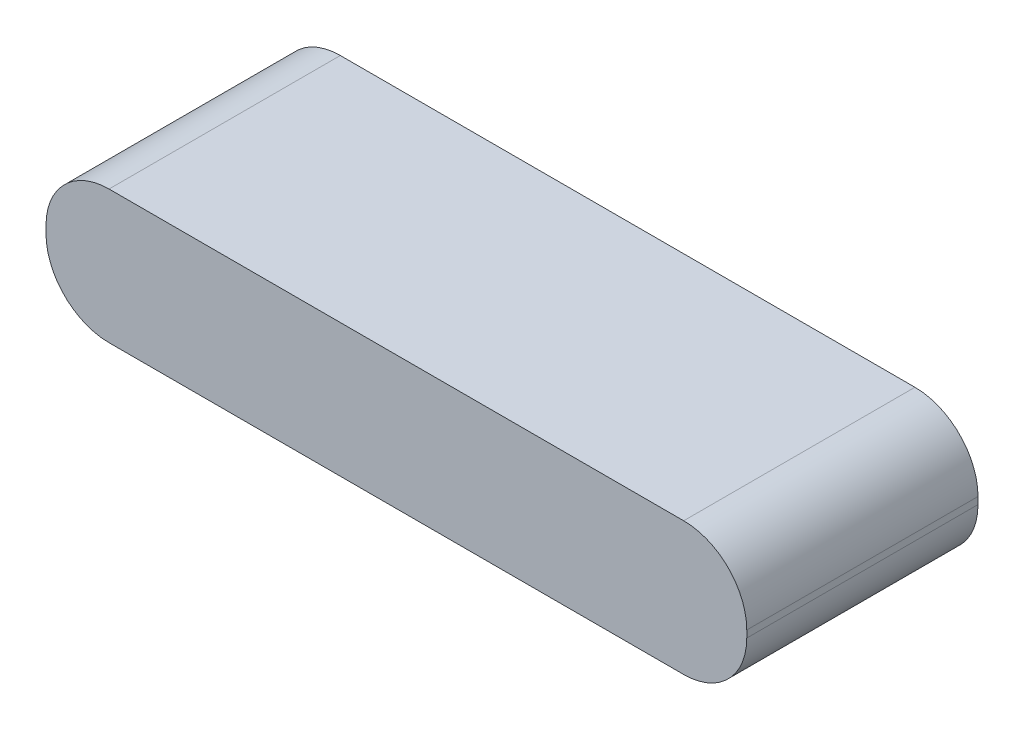
ISO-10303-21;
HEADER;
FILE_DESCRIPTION(('STEP AP214'),'2;1');
FILE_NAME('part.step','',(''),(''),'','','');
FILE_SCHEMA(('AUTOMOTIVE_DESIGN { 1 0 10303 214 1 1 1 1 }'));
ENDSEC;
DATA;
#1=APPLICATION_CONTEXT('core data for automotive mechanical design processes');
#2=APPLICATION_PROTOCOL_DEFINITION('international standard','automotive_design',2000,#1);
#3=PRODUCT_CONTEXT('',#1,'mechanical');
#4=PRODUCT('Part','Part','',(#3));
#5=PRODUCT_RELATED_PRODUCT_CATEGORY('part','',(#4));
#6=PRODUCT_DEFINITION_FORMATION('','',#4);
#7=PRODUCT_DEFINITION_CONTEXT('part definition',#1,'design');
#8=PRODUCT_DEFINITION('design','',#6,#7);
#9=PRODUCT_DEFINITION_SHAPE('','',#8);
#10=(LENGTH_UNIT() NAMED_UNIT(*) SI_UNIT(.MILLI.,.METRE.));
#11=(NAMED_UNIT(*) PLANE_ANGLE_UNIT() SI_UNIT($,.RADIAN.));
#12=(NAMED_UNIT(*) SI_UNIT($,.STERADIAN.) SOLID_ANGLE_UNIT());
#13=UNCERTAINTY_MEASURE_WITH_UNIT(LENGTH_MEASURE(1.E-05),#10,'distance_accuracy_value','');
#14=(GEOMETRIC_REPRESENTATION_CONTEXT(3) GLOBAL_UNCERTAINTY_ASSIGNED_CONTEXT((#13)) GLOBAL_UNIT_ASSIGNED_CONTEXT((#10,
#11,#12)) REPRESENTATION_CONTEXT('',''));
#15=CARTESIAN_POINT('',(0.,0.,0.));
#16=DIRECTION('',(0.,0.,1.));
#17=DIRECTION('',(1.,0.,0.));
#18=AXIS2_PLACEMENT_3D('',#15,#16,#17);
#19=CARTESIAN_POINT('',(50.,19.,-16.5));
#20=DIRECTION('',(-1.,0.,0.));
#21=DIRECTION('',(0.,0.,1.));
#22=AXIS2_PLACEMENT_3D('',#19,#20,#21);
#23=PLANE('',#22);
#24=DIRECTION('',(0.,-1.,0.));
#25=VECTOR('',#24,1.);
#26=CARTESIAN_POINT('',(50.,19.,16.5));
#27=LINE('',#26,#25);
#28=CARTESIAN_POINT('',(50.,10.,16.5));
#29=VERTEX_POINT('',#28);
#30=CARTESIAN_POINT('',(50.,9.,16.5));
#31=VERTEX_POINT('',#30);
#32=EDGE_CURVE('E122',#29,#31,#27,.T.);
#33=ORIENTED_EDGE('',*,*,#32,.T.);
#34=DIRECTION('',(0.,0.,-1.));
#35=VECTOR('',#34,1.);
#36=CARTESIAN_POINT('',(50.,9.,-16.5));
#37=LINE('',#36,#35);
#38=CARTESIAN_POINT('',(50.,9.,-16.5));
#39=VERTEX_POINT('',#38);
#40=EDGE_CURVE('E11',#31,#39,#37,.T.);
#41=ORIENTED_EDGE('',*,*,#40,.T.);
#42=DIRECTION('',(0.,-1.,0.));
#43=VECTOR('',#42,1.);
#44=CARTESIAN_POINT('',(50.,19.,-16.5));
#45=LINE('',#44,#43);
#46=CARTESIAN_POINT('',(50.,10.,-16.5));
#47=VERTEX_POINT('',#46);
#48=EDGE_CURVE('E127',#47,#39,#45,.T.);
#49=ORIENTED_EDGE('',*,*,#48,.F.);
#50=DIRECTION('',(0.,0.,-1.));
#51=VECTOR('',#50,1.);
#52=CARTESIAN_POINT('',(50.,10.,16.5));
#53=LINE('',#52,#51);
#54=EDGE_CURVE('E42',#47,#29,#53,.F.);
#55=ORIENTED_EDGE('',*,*,#54,.T.);
#56=EDGE_LOOP('',(#33,#41,#49,#55));
#57=FACE_BOUND('',#56,.T.);
#58=ADVANCED_FACE('F34',(#57),#23,.F.);
#59=CARTESIAN_POINT('',(-50.,19.,-16.5));
#60=DIRECTION('',(0.,0.,1.));
#61=DIRECTION('',(1.,0.,0.));
#62=AXIS2_PLACEMENT_3D('',#59,#60,#61);
#63=PLANE('',#62);
#64=DIRECTION('',(-1.,0.,0.));
#65=VECTOR('',#64,1.);
#66=CARTESIAN_POINT('',(-50.,0.,-16.5));
#67=LINE('',#66,#65);
#68=CARTESIAN_POINT('',(41.,0.,-16.5));
#69=VERTEX_POINT('',#68);
#70=CARTESIAN_POINT('',(-41.,0.,-16.5));
#71=VERTEX_POINT('',#70);
#72=EDGE_CURVE('E169',#69,#71,#67,.T.);
#73=ORIENTED_EDGE('',*,*,#72,.T.);
#74=CARTESIAN_POINT('',(-41.,9.,-16.5));
#75=DIRECTION('',(0.,0.,1.));
#76=DIRECTION('',(1.,0.,0.));
#77=AXIS2_PLACEMENT_3D('',#74,#75,#76);
#78=CIRCLE('',#77,9.);
#79=CARTESIAN_POINT('',(-50.,9.,-16.5));
#80=VERTEX_POINT('',#79);
#81=EDGE_CURVE('E144',#71,#80,#78,.F.);
#82=ORIENTED_EDGE('',*,*,#81,.T.);
#83=DIRECTION('',(0.,-1.,0.));
#84=VECTOR('',#83,1.);
#85=CARTESIAN_POINT('',(-50.,19.,-16.5));
#86=LINE('',#85,#84);
#87=CARTESIAN_POINT('',(-50.,10.,-16.5));
#88=VERTEX_POINT('',#87);
#89=EDGE_CURVE('E121',#88,#80,#86,.T.);
#90=ORIENTED_EDGE('',*,*,#89,.F.);
#91=CARTESIAN_POINT('',(-41.,10.,-16.5));
#92=DIRECTION('',(0.,0.,1.));
#93=DIRECTION('',(1.,0.,0.));
#94=AXIS2_PLACEMENT_3D('',#91,#92,#93);
#95=CIRCLE('',#94,9.);
#96=CARTESIAN_POINT('',(-41.,19.,-16.5));
#97=VERTEX_POINT('',#96);
#98=EDGE_CURVE('E126',#88,#97,#95,.F.);
#99=ORIENTED_EDGE('',*,*,#98,.T.);
#100=DIRECTION('',(-1.,0.,0.));
#101=VECTOR('',#100,1.);
#102=CARTESIAN_POINT('',(-50.,19.,-16.5));
#103=LINE('',#102,#101);
#104=CARTESIAN_POINT('',(41.,19.,-16.5));
#105=VERTEX_POINT('',#104);
#106=EDGE_CURVE('E163',#105,#97,#103,.T.);
#107=ORIENTED_EDGE('',*,*,#106,.F.);
#108=CARTESIAN_POINT('',(41.,10.,-16.5));
#109=DIRECTION('',(0.,0.,1.));
#110=DIRECTION('',(1.,0.,0.));
#111=AXIS2_PLACEMENT_3D('',#108,#109,#110);
#112=CIRCLE('',#111,9.);
#113=EDGE_CURVE('E56',#105,#47,#112,.F.);
#114=ORIENTED_EDGE('',*,*,#113,.T.);
#115=ORIENTED_EDGE('',*,*,#48,.T.);
#116=CARTESIAN_POINT('',(41.,9.,-16.5));
#117=DIRECTION('',(0.,0.,1.));
#118=DIRECTION('',(1.,0.,0.));
#119=AXIS2_PLACEMENT_3D('',#116,#117,#118);
#120=CIRCLE('',#119,9.);
#121=EDGE_CURVE('E49',#39,#69,#120,.F.);
#122=ORIENTED_EDGE('',*,*,#121,.T.);
#123=EDGE_LOOP('',(#73,#82,#90,#99,#107,#114,#115,#122));
#124=FACE_BOUND('',#123,.T.);
#125=ADVANCED_FACE('F165',(#124),#63,.F.);
#126=CARTESIAN_POINT('',(-50.,19.,-16.5));
#127=DIRECTION('',(1.,0.,0.));
#128=DIRECTION('',(0.,0.,-1.));
#129=AXIS2_PLACEMENT_3D('',#126,#127,#128);
#130=PLANE('',#129);
#131=ORIENTED_EDGE('',*,*,#89,.T.);
#132=DIRECTION('',(0.,0.,1.));
#133=VECTOR('',#132,1.);
#134=CARTESIAN_POINT('',(-50.,9.,-16.5));
#135=LINE('',#134,#133);
#136=CARTESIAN_POINT('',(-50.,9.,16.5));
#137=VERTEX_POINT('',#136);
#138=EDGE_CURVE('E120',#80,#137,#135,.T.);
#139=ORIENTED_EDGE('',*,*,#138,.T.);
#140=DIRECTION('',(0.,-1.,0.));
#141=VECTOR('',#140,1.);
#142=CARTESIAN_POINT('',(-50.,19.,16.5));
#143=LINE('',#142,#141);
#144=CARTESIAN_POINT('',(-50.,10.,16.5));
#145=VERTEX_POINT('',#144);
#146=EDGE_CURVE('E103',#145,#137,#143,.T.);
#147=ORIENTED_EDGE('',*,*,#146,.F.);
#148=DIRECTION('',(0.,0.,1.));
#149=VECTOR('',#148,1.);
#150=CARTESIAN_POINT('',(-50.,10.,-16.5));
#151=LINE('',#150,#149);
#152=EDGE_CURVE('E117',#145,#88,#151,.F.);
#153=ORIENTED_EDGE('',*,*,#152,.T.);
#154=EDGE_LOOP('',(#131,#139,#147,#153));
#155=FACE_BOUND('',#154,.T.);
#156=ADVANCED_FACE('F116',(#155),#130,.F.);
#157=CARTESIAN_POINT('',(-50.,19.,16.5));
#158=DIRECTION('',(0.,0.,-1.));
#159=DIRECTION('',(-1.,0.,0.));
#160=AXIS2_PLACEMENT_3D('',#157,#158,#159);
#161=PLANE('',#160);
#162=ORIENTED_EDGE('',*,*,#146,.T.);
#163=CARTESIAN_POINT('',(-41.,9.,16.5));
#164=DIRECTION('',(0.,0.,-1.));
#165=DIRECTION('',(-1.,0.,0.));
#166=AXIS2_PLACEMENT_3D('',#163,#164,#165);
#167=CIRCLE('',#166,9.);
#168=CARTESIAN_POINT('',(-41.,0.,16.5));
#169=VERTEX_POINT('',#168);
#170=EDGE_CURVE('E110',#137,#169,#167,.F.);
#171=ORIENTED_EDGE('',*,*,#170,.T.);
#172=DIRECTION('',(1.,0.,0.));
#173=VECTOR('',#172,1.);
#174=CARTESIAN_POINT('',(-50.,0.,16.5));
#175=LINE('',#174,#173);
#176=CARTESIAN_POINT('',(41.,0.,16.5));
#177=VERTEX_POINT('',#176);
#178=EDGE_CURVE('E166',#169,#177,#175,.T.);
#179=ORIENTED_EDGE('',*,*,#178,.T.);
#180=CARTESIAN_POINT('',(41.,9.,16.5));
#181=DIRECTION('',(0.,0.,-1.));
#182=DIRECTION('',(-1.,0.,0.));
#183=AXIS2_PLACEMENT_3D('',#180,#181,#182);
#184=CIRCLE('',#183,9.);
#185=EDGE_CURVE('E111',#177,#31,#184,.F.);
#186=ORIENTED_EDGE('',*,*,#185,.T.);
#187=ORIENTED_EDGE('',*,*,#32,.F.);
#188=CARTESIAN_POINT('',(41.,10.,16.5));
#189=DIRECTION('',(0.,0.,-1.));
#190=DIRECTION('',(-1.,0.,0.));
#191=AXIS2_PLACEMENT_3D('',#188,#189,#190);
#192=CIRCLE('',#191,9.);
#193=CARTESIAN_POINT('',(41.,19.,16.5));
#194=VERTEX_POINT('',#193);
#195=EDGE_CURVE('E129',#29,#194,#192,.F.);
#196=ORIENTED_EDGE('',*,*,#195,.T.);
#197=DIRECTION('',(1.,0.,0.));
#198=VECTOR('',#197,1.);
#199=CARTESIAN_POINT('',(-50.,19.,16.5));
#200=LINE('',#199,#198);
#201=CARTESIAN_POINT('',(-41.,19.,16.5));
#202=VERTEX_POINT('',#201);
#203=EDGE_CURVE('E105',#202,#194,#200,.T.);
#204=ORIENTED_EDGE('',*,*,#203,.F.);
#205=CARTESIAN_POINT('',(-41.,10.,16.5));
#206=DIRECTION('',(0.,0.,-1.));
#207=DIRECTION('',(-1.,0.,0.));
#208=AXIS2_PLACEMENT_3D('',#205,#206,#207);
#209=CIRCLE('',#208,9.);
#210=EDGE_CURVE('E100',#202,#145,#209,.F.);
#211=ORIENTED_EDGE('',*,*,#210,.T.);
#212=EDGE_LOOP('',(#162,#171,#179,#186,#187,#196,#204,#211));
#213=FACE_BOUND('',#212,.T.);
#214=ADVANCED_FACE('F102',(#213),#161,.F.);
#215=CARTESIAN_POINT('',(0.,19.,0.));
#216=DIRECTION('',(0.,1.,0.));
#217=DIRECTION('',(0.,0.,1.));
#218=AXIS2_PLACEMENT_3D('',#215,#216,#217);
#219=PLANE('',#218);
#220=ORIENTED_EDGE('',*,*,#106,.T.);
#221=DIRECTION('',(0.,0.,1.));
#222=VECTOR('',#221,1.);
#223=CARTESIAN_POINT('',(-41.,19.,16.5));
#224=LINE('',#223,#222);
#225=EDGE_CURVE('E149',#97,#202,#224,.T.);
#226=ORIENTED_EDGE('',*,*,#225,.T.);
#227=ORIENTED_EDGE('',*,*,#203,.T.);
#228=DIRECTION('',(0.,0.,-1.));
#229=VECTOR('',#228,1.);
#230=CARTESIAN_POINT('',(41.,19.,-16.5));
#231=LINE('',#230,#229);
#232=EDGE_CURVE('E146',#194,#105,#231,.T.);
#233=ORIENTED_EDGE('',*,*,#232,.T.);
#234=EDGE_LOOP('',(#220,#226,#227,#233));
#235=FACE_BOUND('',#234,.T.);
#236=ADVANCED_FACE('F162',(#235),#219,.T.);
#237=CARTESIAN_POINT('',(0.,0.,0.));
#238=DIRECTION('',(0.,1.,0.));
#239=DIRECTION('',(0.,0.,1.));
#240=AXIS2_PLACEMENT_3D('',#237,#238,#239);
#241=PLANE('',#240);
#242=ORIENTED_EDGE('',*,*,#178,.F.);
#243=DIRECTION('',(0.,0.,1.));
#244=VECTOR('',#243,1.);
#245=CARTESIAN_POINT('',(-41.,0.,0.));
#246=LINE('',#245,#244);
#247=EDGE_CURVE('E139',#169,#71,#246,.F.);
#248=ORIENTED_EDGE('',*,*,#247,.T.);
#249=ORIENTED_EDGE('',*,*,#72,.F.);
#250=DIRECTION('',(0.,0.,-1.));
#251=VECTOR('',#250,1.);
#252=CARTESIAN_POINT('',(41.,0.,0.));
#253=LINE('',#252,#251);
#254=EDGE_CURVE('E137',#69,#177,#253,.F.);
#255=ORIENTED_EDGE('',*,*,#254,.T.);
#256=EDGE_LOOP('',(#242,#248,#249,#255));
#257=FACE_BOUND('',#256,.T.);
#258=ADVANCED_FACE('F178',(#257),#241,.F.);
#259=CARTESIAN_POINT('',(-41.,9.,-16.5));
#260=DIRECTION('',(0.,0.,1.));
#261=DIRECTION('',(1.,0.,0.));
#262=AXIS2_PLACEMENT_3D('',#259,#260,#261);
#263=CYLINDRICAL_SURFACE('',#262,9.);
#264=ORIENTED_EDGE('',*,*,#81,.F.);
#265=ORIENTED_EDGE('',*,*,#247,.F.);
#266=ORIENTED_EDGE('',*,*,#170,.F.);
#267=ORIENTED_EDGE('',*,*,#138,.F.);
#268=EDGE_LOOP('',(#264,#265,#266,#267));
#269=FACE_BOUND('',#268,.T.);
#270=ADVANCED_FACE('F174',(#269),#263,.T.);
#271=CARTESIAN_POINT('',(-41.,10.,0.));
#272=DIRECTION('',(0.,0.,-1.));
#273=DIRECTION('',(-1.,0.,0.));
#274=AXIS2_PLACEMENT_3D('',#271,#272,#273);
#275=CYLINDRICAL_SURFACE('',#274,9.);
#276=ORIENTED_EDGE('',*,*,#98,.F.);
#277=ORIENTED_EDGE('',*,*,#152,.F.);
#278=ORIENTED_EDGE('',*,*,#210,.F.);
#279=ORIENTED_EDGE('',*,*,#225,.F.);
#280=EDGE_LOOP('',(#276,#277,#278,#279));
#281=FACE_BOUND('',#280,.T.);
#282=ADVANCED_FACE('F125',(#281),#275,.T.);
#283=CARTESIAN_POINT('',(41.,9.,-16.5));
#284=DIRECTION('',(0.,0.,-1.));
#285=DIRECTION('',(-1.,0.,0.));
#286=AXIS2_PLACEMENT_3D('',#283,#284,#285);
#287=CYLINDRICAL_SURFACE('',#286,9.);
#288=ORIENTED_EDGE('',*,*,#185,.F.);
#289=ORIENTED_EDGE('',*,*,#254,.F.);
#290=ORIENTED_EDGE('',*,*,#121,.F.);
#291=ORIENTED_EDGE('',*,*,#40,.F.);
#292=EDGE_LOOP('',(#288,#289,#290,#291));
#293=FACE_BOUND('',#292,.T.);
#294=ADVANCED_FACE('F180',(#293),#287,.T.);
#295=CARTESIAN_POINT('',(41.,10.,0.));
#296=DIRECTION('',(0.,0.,1.));
#297=DIRECTION('',(1.,0.,0.));
#298=AXIS2_PLACEMENT_3D('',#295,#296,#297);
#299=CYLINDRICAL_SURFACE('',#298,9.);
#300=ORIENTED_EDGE('',*,*,#195,.F.);
#301=ORIENTED_EDGE('',*,*,#54,.F.);
#302=ORIENTED_EDGE('',*,*,#113,.F.);
#303=ORIENTED_EDGE('',*,*,#232,.F.);
#304=EDGE_LOOP('',(#300,#301,#302,#303));
#305=FACE_BOUND('',#304,.T.);
#306=ADVANCED_FACE('F36',(#305),#299,.T.);
#307=CLOSED_SHELL('',(#58,#125,#156,#214,#236,#258,#270,#282,#294,#306));
#308=MANIFOLD_SOLID_BREP('B2',#307);
#309=ADVANCED_BREP_SHAPE_REPRESENTATION('',(#18,#308),#14);
#310=SHAPE_DEFINITION_REPRESENTATION(#9,#309);
ENDSEC;
END-ISO-10303-21;
